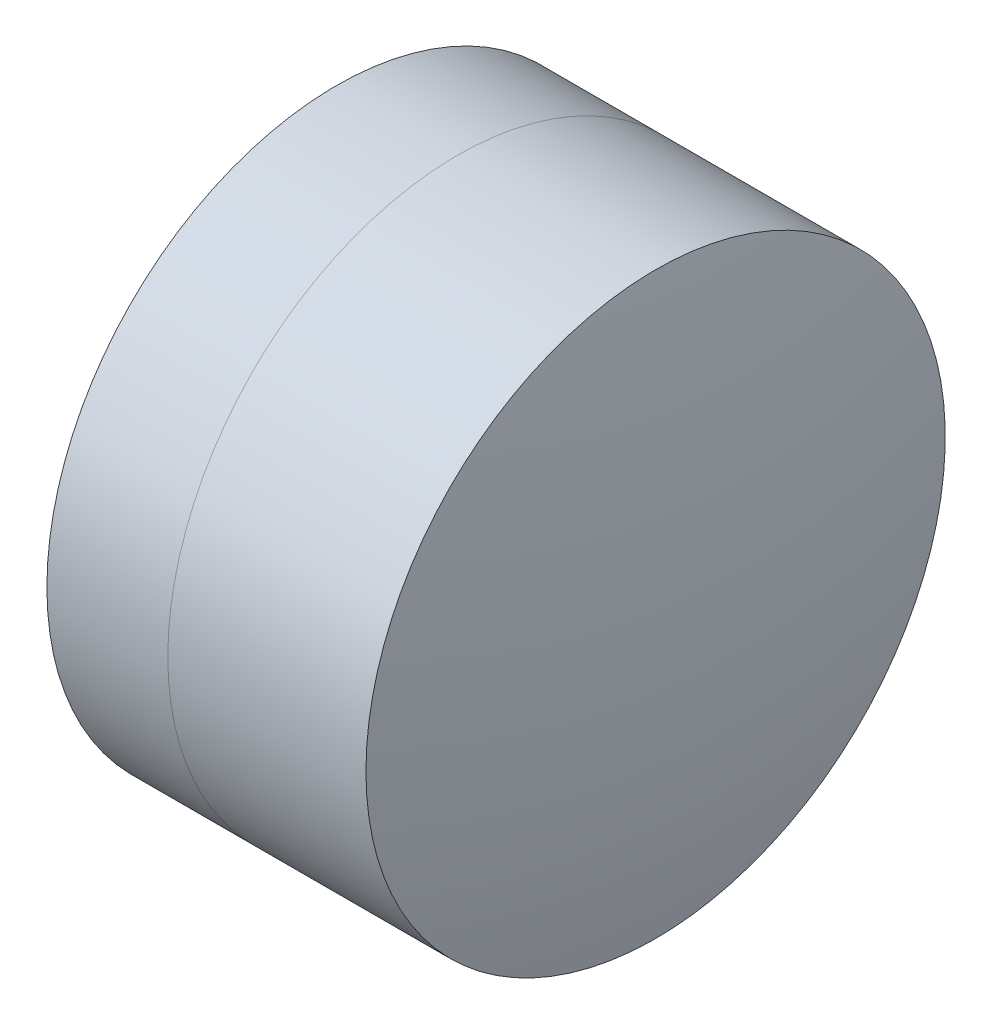
ISO-10303-21;
HEADER;
FILE_DESCRIPTION(('STEP AP214'),'2;1');
FILE_NAME('part.step','',(''),(''),'','','');
FILE_SCHEMA(('AUTOMOTIVE_DESIGN { 1 0 10303 214 1 1 1 1 }'));
ENDSEC;
DATA;
#1=APPLICATION_CONTEXT('core data for automotive mechanical design processes');
#2=APPLICATION_PROTOCOL_DEFINITION('international standard','automotive_design',2000,#1);
#3=PRODUCT_CONTEXT('',#1,'mechanical');
#4=PRODUCT('Part','Part','',(#3));
#5=PRODUCT_RELATED_PRODUCT_CATEGORY('part','',(#4));
#6=PRODUCT_DEFINITION_FORMATION('','',#4);
#7=PRODUCT_DEFINITION_CONTEXT('part definition',#1,'design');
#8=PRODUCT_DEFINITION('design','',#6,#7);
#9=PRODUCT_DEFINITION_SHAPE('','',#8);
#10=(LENGTH_UNIT() NAMED_UNIT(*) SI_UNIT(.MILLI.,.METRE.));
#11=(NAMED_UNIT(*) PLANE_ANGLE_UNIT() SI_UNIT($,.RADIAN.));
#12=(NAMED_UNIT(*) SI_UNIT($,.STERADIAN.) SOLID_ANGLE_UNIT());
#13=UNCERTAINTY_MEASURE_WITH_UNIT(LENGTH_MEASURE(1.E-05),#10,'distance_accuracy_value','');
#14=(GEOMETRIC_REPRESENTATION_CONTEXT(3) GLOBAL_UNCERTAINTY_ASSIGNED_CONTEXT((#13)) GLOBAL_UNIT_ASSIGNED_CONTEXT((#10,
#11,#12)) REPRESENTATION_CONTEXT('',''));
#15=CARTESIAN_POINT('',(0.,0.,0.));
#16=DIRECTION('',(0.,0.,1.));
#17=DIRECTION('',(1.,0.,0.));
#18=AXIS2_PLACEMENT_3D('',#15,#16,#17);
#19=CARTESIAN_POINT('',(1.09460433993269,0.,0.));
#20=DIRECTION('',(-1.,0.,0.));
#21=DIRECTION('',(0.,0.,1.));
#22=AXIS2_PLACEMENT_3D('',#19,#20,#21);
#23=SPHERICAL_SURFACE('',#22,5.396);
#24=CARTESIAN_POINT('',(5.47573615716896,0.,0.));
#25=DIRECTION('',(-1.,0.,0.));
#26=DIRECTION('',(0.,0.,1.));
#27=AXIS2_PLACEMENT_3D('',#24,#25,#26);
#28=CIRCLE('',#27,3.15);
#29=CARTESIAN_POINT('',(5.47573615716896,0.,3.15));
#30=VERTEX_POINT('',#29);
#31=EDGE_CURVE('E11',#30,#30,#28,.T.);
#32=ORIENTED_EDGE('',*,*,#31,.T.);
#33=EDGE_LOOP('',(#32));
#34=FACE_BOUND('',#33,.T.);
#35=ADVANCED_FACE('F45',(#34),#23,.F.);
#36=CARTESIAN_POINT('',(-0.551919992657797,0.,0.));
#37=DIRECTION('',(-1.,0.,0.));
#38=DIRECTION('',(0.,0.,1.));
#39=AXIS2_PLACEMENT_3D('',#36,#37,#38);
#40=CYLINDRICAL_SURFACE('',#39,3.15);
#41=CARTESIAN_POINT('',(7.63034689540151,0.,0.));
#42=DIRECTION('',(-1.,0.,0.));
#43=DIRECTION('',(0.,0.,1.));
#44=AXIS2_PLACEMENT_3D('',#41,#42,#43);
#45=CIRCLE('',#44,3.15);
#46=CARTESIAN_POINT('',(7.63034689540151,0.,3.15));
#47=VERTEX_POINT('',#46);
#48=EDGE_CURVE('E51',#47,#47,#45,.T.);
#49=ORIENTED_EDGE('',*,*,#48,.T.);
#50=EDGE_LOOP('',(#49));
#51=FACE_BOUND('',#50,.T.);
#52=ORIENTED_EDGE('',*,*,#31,.F.);
#53=EDGE_LOOP('',(#52));
#54=FACE_BOUND('',#53,.T.);
#55=ADVANCED_FACE('F57',(#51,#54),#40,.T.);
#56=CARTESIAN_POINT('',(-6.78039566006731,0.,0.));
#57=DIRECTION('',(-1.,0.,0.));
#58=DIRECTION('',(0.,0.,1.));
#59=AXIS2_PLACEMENT_3D('',#56,#57,#58);
#60=SPHERICAL_SURFACE('',#59,14.751);
#61=ORIENTED_EDGE('',*,*,#48,.F.);
#62=EDGE_LOOP('',(#61));
#63=FACE_BOUND('',#62,.T.);
#64=ADVANCED_FACE('F60',(#63),#60,.T.);
#65=CLOSED_SHELL('',(#35,#55,#64));
#66=MANIFOLD_SOLID_BREP('B2',#65);
#67=CARTESIAN_POINT('',(11.7146043399327,0.,0.));
#68=DIRECTION('',(-1.,0.,0.));
#69=DIRECTION('',(0.,0.,1.));
#70=AXIS2_PLACEMENT_3D('',#67,#68,#69);
#71=SPHERICAL_SURFACE('',#70,8.184);
#72=CARTESIAN_POINT('',(4.16110475364819,0.,0.));
#73=DIRECTION('',(-1.,0.,0.));
#74=DIRECTION('',(0.,0.,1.));
#75=AXIS2_PLACEMENT_3D('',#72,#73,#74);
#76=CIRCLE('',#75,3.15);
#77=CARTESIAN_POINT('',(4.16110475364819,0.,3.15));
#78=VERTEX_POINT('',#77);
#79=EDGE_CURVE('E44',#78,#78,#76,.T.);
#80=ORIENTED_EDGE('',*,*,#79,.T.);
#81=EDGE_LOOP('',(#80));
#82=FACE_BOUND('',#81,.T.);
#83=ADVANCED_FACE('F86',(#82),#71,.T.);
#84=CARTESIAN_POINT('',(-0.816062176165804,0.,0.));
#85=DIRECTION('',(-1.,0.,0.));
#86=DIRECTION('',(0.,0.,1.));
#87=AXIS2_PLACEMENT_3D('',#84,#85,#86);
#88=CYLINDRICAL_SURFACE('',#87,3.15);
#89=CARTESIAN_POINT('',(5.47573615716896,0.,0.));
#90=DIRECTION('',(-1.,0.,0.));
#91=DIRECTION('',(0.,0.,1.));
#92=AXIS2_PLACEMENT_3D('',#89,#90,#91);
#93=CIRCLE('',#92,3.15);
#94=CARTESIAN_POINT('',(5.47573615716896,0.,3.15));
#95=VERTEX_POINT('',#94);
#96=EDGE_CURVE('E92',#95,#95,#93,.T.);
#97=ORIENTED_EDGE('',*,*,#96,.T.);
#98=EDGE_LOOP('',(#97));
#99=FACE_BOUND('',#98,.T.);
#100=ORIENTED_EDGE('',*,*,#79,.F.);
#101=EDGE_LOOP('',(#100));
#102=FACE_BOUND('',#101,.T.);
#103=ADVANCED_FACE('F98',(#99,#102),#88,.T.);
#104=CARTESIAN_POINT('',(1.09460433993269,0.,0.));
#105=DIRECTION('',(-1.,0.,0.));
#106=DIRECTION('',(0.,0.,1.));
#107=AXIS2_PLACEMENT_3D('',#104,#105,#106);
#108=SPHERICAL_SURFACE('',#107,5.396);
#109=ORIENTED_EDGE('',*,*,#96,.F.);
#110=EDGE_LOOP('',(#109));
#111=FACE_BOUND('',#110,.T.);
#112=ADVANCED_FACE('F101',(#111),#108,.T.);
#113=CLOSED_SHELL('',(#83,#103,#112));
#114=MANIFOLD_SOLID_BREP('B6',#113);
#115=ADVANCED_BREP_SHAPE_REPRESENTATION('',(#18,#66,#114),#14);
#116=SHAPE_DEFINITION_REPRESENTATION(#9,#115);
ENDSEC;
END-ISO-10303-21;
